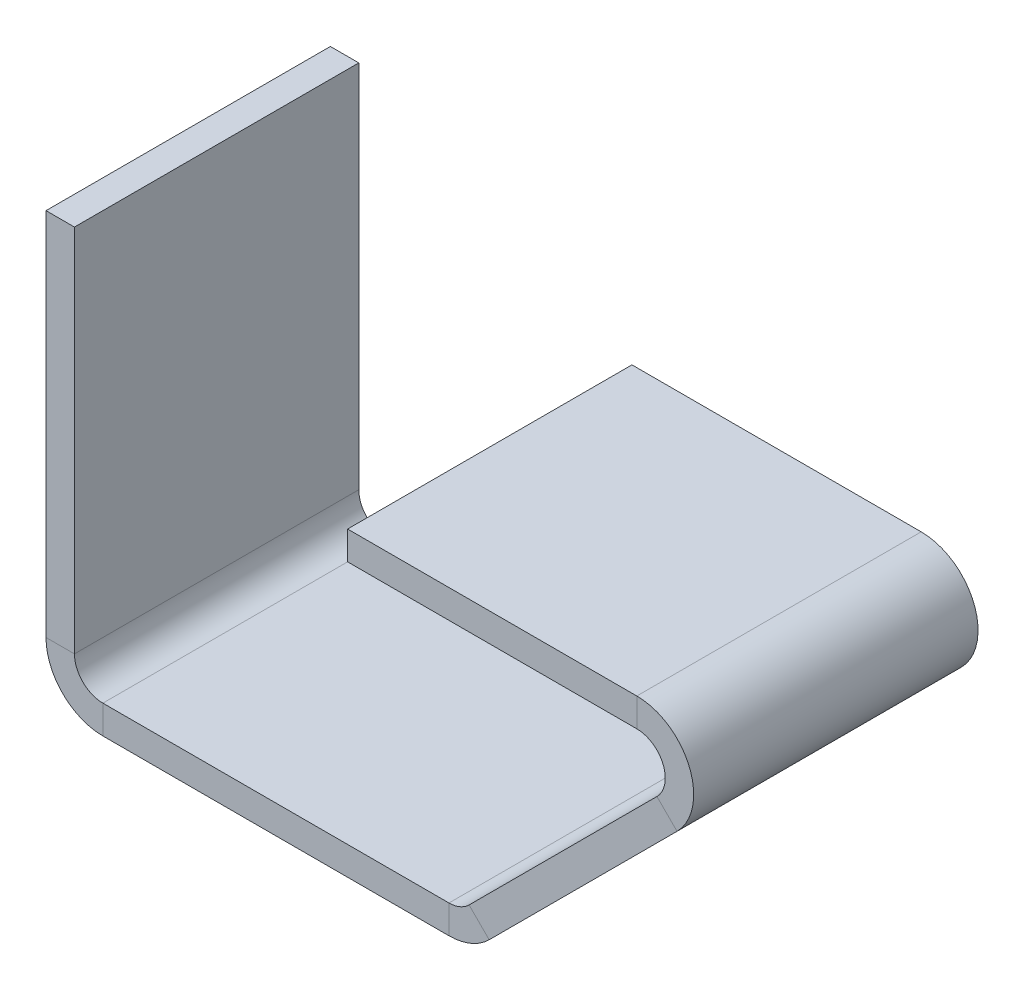
ISO-10303-21;
HEADER;
FILE_DESCRIPTION(('STEP AP214'),'2;1');
FILE_NAME('part.step','',(''),(''),'','','');
FILE_SCHEMA(('AUTOMOTIVE_DESIGN { 1 0 10303 214 1 1 1 1 }'));
ENDSEC;
DATA;
#1=APPLICATION_CONTEXT('core data for automotive mechanical design processes');
#2=APPLICATION_PROTOCOL_DEFINITION('international standard','automotive_design',2000,#1);
#3=PRODUCT_CONTEXT('',#1,'mechanical');
#4=PRODUCT('Part','Part','',(#3));
#5=PRODUCT_RELATED_PRODUCT_CATEGORY('part','',(#4));
#6=PRODUCT_DEFINITION_FORMATION('','',#4);
#7=PRODUCT_DEFINITION_CONTEXT('part definition',#1,'design');
#8=PRODUCT_DEFINITION('design','',#6,#7);
#9=PRODUCT_DEFINITION_SHAPE('','',#8);
#10=(LENGTH_UNIT() NAMED_UNIT(*) SI_UNIT(.MILLI.,.METRE.));
#11=(NAMED_UNIT(*) PLANE_ANGLE_UNIT() SI_UNIT($,.RADIAN.));
#12=(NAMED_UNIT(*) SI_UNIT($,.STERADIAN.) SOLID_ANGLE_UNIT());
#13=UNCERTAINTY_MEASURE_WITH_UNIT(LENGTH_MEASURE(1.E-05),#10,'distance_accuracy_value','');
#14=(GEOMETRIC_REPRESENTATION_CONTEXT(3) GLOBAL_UNCERTAINTY_ASSIGNED_CONTEXT((#13)) GLOBAL_UNIT_ASSIGNED_CONTEXT((#10,
#11,#12)) REPRESENTATION_CONTEXT('',''));
#15=CARTESIAN_POINT('',(0.,0.,0.));
#16=DIRECTION('',(0.,0.,1.));
#17=DIRECTION('',(1.,0.,0.));
#18=AXIS2_PLACEMENT_3D('',#15,#16,#17);
#19=CARTESIAN_POINT('',(0.,4.00000000000002,10.));
#20=DIRECTION('',(0.,0.,1.));
#21=DIRECTION('',(1.,0.,0.));
#22=AXIS2_PLACEMENT_3D('',#19,#20,#21);
#23=PLANE('',#22);
#24=DIRECTION('',(1.,0.,0.));
#25=VECTOR('',#24,1.);
#26=CARTESIAN_POINT('',(0.,4.00000000000002,10.));
#27=LINE('',#26,#25);
#28=CARTESIAN_POINT('',(0.,4.00000000000002,10.));
#29=VERTEX_POINT('',#28);
#30=CARTESIAN_POINT('',(2.,4.00000000000001,10.));
#31=VERTEX_POINT('',#30);
#32=EDGE_CURVE('E11',#29,#31,#27,.T.);
#33=ORIENTED_EDGE('',*,*,#32,.F.);
#34=CARTESIAN_POINT('',(4.,4.,10.));
#35=DIRECTION('',(0.,0.,-1.));
#36=DIRECTION('',(-1.,0.,0.));
#37=AXIS2_PLACEMENT_3D('',#34,#35,#36);
#38=CIRCLE('',#37,4.);
#39=CARTESIAN_POINT('',(4.,0.,10.));
#40=VERTEX_POINT('',#39);
#41=EDGE_CURVE('E359',#29,#40,#38,.F.);
#42=ORIENTED_EDGE('',*,*,#41,.T.);
#43=DIRECTION('',(0.,-1.,0.));
#44=VECTOR('',#43,1.);
#45=CARTESIAN_POINT('',(4.,2.,10.));
#46=LINE('',#45,#44);
#47=CARTESIAN_POINT('',(4.,2.,10.));
#48=VERTEX_POINT('',#47);
#49=EDGE_CURVE('E52',#48,#40,#46,.T.);
#50=ORIENTED_EDGE('',*,*,#49,.F.);
#51=CARTESIAN_POINT('',(4.,4.,10.));
#52=DIRECTION('',(0.,0.,1.));
#53=DIRECTION('',(1.,0.,0.));
#54=AXIS2_PLACEMENT_3D('',#51,#52,#53);
#55=CIRCLE('',#54,2.);
#56=EDGE_CURVE('E384',#31,#48,#55,.T.);
#57=ORIENTED_EDGE('',*,*,#56,.F.);
#58=EDGE_LOOP('',(#33,#42,#50,#57));
#59=FACE_BOUND('',#58,.T.);
#60=ADVANCED_FACE('F43',(#59),#23,.T.);
#61=CARTESIAN_POINT('',(4.,2.,10.));
#62=DIRECTION('',(0.,0.,1.));
#63=DIRECTION('',(1.,0.,0.));
#64=AXIS2_PLACEMENT_3D('',#61,#62,#63);
#65=PLANE('',#64);
#66=DIRECTION('',(0.,-1.,0.));
#67=VECTOR('',#66,1.);
#68=CARTESIAN_POINT('',(0.,30.,10.));
#69=LINE('',#68,#67);
#70=CARTESIAN_POINT('',(0.,30.,10.));
#71=VERTEX_POINT('',#70);
#72=EDGE_CURVE('E364',#71,#29,#69,.T.);
#73=ORIENTED_EDGE('',*,*,#72,.T.);
#74=ORIENTED_EDGE('',*,*,#32,.T.);
#75=DIRECTION('',(0.,1.,0.));
#76=VECTOR('',#75,1.);
#77=CARTESIAN_POINT('',(2.,30.,10.));
#78=LINE('',#77,#76);
#79=CARTESIAN_POINT('',(2.,30.,10.));
#80=VERTEX_POINT('',#79);
#81=EDGE_CURVE('E380',#80,#31,#78,.F.);
#82=ORIENTED_EDGE('',*,*,#81,.F.);
#83=DIRECTION('',(1.,0.,0.));
#84=VECTOR('',#83,1.);
#85=CARTESIAN_POINT('',(0.,30.,10.));
#86=LINE('',#85,#84);
#87=EDGE_CURVE('E376',#71,#80,#86,.T.);
#88=ORIENTED_EDGE('',*,*,#87,.F.);
#89=EDGE_LOOP('',(#73,#74,#82,#88));
#90=FACE_BOUND('',#89,.T.);
#91=ADVANCED_FACE('F470',(#90),#65,.T.);
#92=CARTESIAN_POINT('',(4.,0.,-10.));
#93=DIRECTION('',(0.,0.,-1.));
#94=DIRECTION('',(-1.,0.,0.));
#95=AXIS2_PLACEMENT_3D('',#92,#93,#94);
#96=PLANE('',#95);
#97=DIRECTION('',(0.,1.,0.));
#98=VECTOR('',#97,1.);
#99=CARTESIAN_POINT('',(4.,0.,-10.));
#100=LINE('',#99,#98);
#101=CARTESIAN_POINT('',(4.,0.,-10.));
#102=VERTEX_POINT('',#101);
#103=CARTESIAN_POINT('',(4.,2.,-10.));
#104=VERTEX_POINT('',#103);
#105=EDGE_CURVE('E342',#102,#104,#100,.T.);
#106=ORIENTED_EDGE('',*,*,#105,.F.);
#107=CARTESIAN_POINT('',(4.,4.,-10.));
#108=DIRECTION('',(0.,0.,-1.));
#109=DIRECTION('',(-1.,0.,0.));
#110=AXIS2_PLACEMENT_3D('',#107,#108,#109);
#111=CIRCLE('',#110,4.);
#112=CARTESIAN_POINT('',(0.,4.00000000000002,-10.));
#113=VERTEX_POINT('',#112);
#114=EDGE_CURVE('E256',#113,#102,#111,.F.);
#115=ORIENTED_EDGE('',*,*,#114,.F.);
#116=DIRECTION('',(-1.,0.,0.));
#117=VECTOR('',#116,1.);
#118=CARTESIAN_POINT('',(2.,4.00000000000001,-10.));
#119=LINE('',#118,#117);
#120=CARTESIAN_POINT('',(2.,4.00000000000001,-10.));
#121=VERTEX_POINT('',#120);
#122=EDGE_CURVE('E339',#121,#113,#119,.T.);
#123=ORIENTED_EDGE('',*,*,#122,.F.);
#124=CARTESIAN_POINT('',(4.,4.,-10.));
#125=DIRECTION('',(0.,0.,1.));
#126=DIRECTION('',(1.,0.,0.));
#127=AXIS2_PLACEMENT_3D('',#124,#125,#126);
#128=CIRCLE('',#127,2.);
#129=EDGE_CURVE('E240',#121,#104,#128,.T.);
#130=ORIENTED_EDGE('',*,*,#129,.T.);
#131=EDGE_LOOP('',(#106,#115,#123,#130));
#132=FACE_BOUND('',#131,.T.);
#133=ADVANCED_FACE('F480',(#132),#96,.T.);
#134=CARTESIAN_POINT('',(2.,4.00000000000001,-10.));
#135=DIRECTION('',(0.,0.,-1.));
#136=DIRECTION('',(-1.,0.,0.));
#137=AXIS2_PLACEMENT_3D('',#134,#135,#136);
#138=PLANE('',#137);
#139=DIRECTION('',(1.,0.,0.));
#140=VECTOR('',#139,1.);
#141=CARTESIAN_POINT('',(0.,0.,-10.));
#142=LINE('',#141,#140);
#143=CARTESIAN_POINT('',(28.3431457505076,0.,-10.));
#144=VERTEX_POINT('',#143);
#145=EDGE_CURVE('E260',#102,#144,#142,.T.);
#146=ORIENTED_EDGE('',*,*,#145,.F.);
#147=ORIENTED_EDGE('',*,*,#105,.T.);
#148=DIRECTION('',(1.,0.,0.));
#149=VECTOR('',#148,1.);
#150=CARTESIAN_POINT('',(0.,2.,-10.));
#151=LINE('',#150,#149);
#152=CARTESIAN_POINT('',(28.3431457505076,2.,-10.));
#153=VERTEX_POINT('',#152);
#154=EDGE_CURVE('E236',#104,#153,#151,.T.);
#155=ORIENTED_EDGE('',*,*,#154,.T.);
#156=DIRECTION('',(0.,-1.,0.));
#157=VECTOR('',#156,1.);
#158=CARTESIAN_POINT('',(28.3431457505076,2.,-10.));
#159=LINE('',#158,#157);
#160=EDGE_CURVE('E332',#153,#144,#159,.T.);
#161=ORIENTED_EDGE('',*,*,#160,.T.);
#162=EDGE_LOOP('',(#146,#147,#155,#161));
#163=FACE_BOUND('',#162,.T.);
#164=ADVANCED_FACE('F482',(#163),#138,.T.);
#165=CARTESIAN_POINT('',(28.3431457505076,0.,10.));
#166=DIRECTION('',(0.,0.,1.));
#167=DIRECTION('',(1.,0.,0.));
#168=AXIS2_PLACEMENT_3D('',#165,#166,#167);
#169=PLANE('',#168);
#170=DIRECTION('',(0.,1.,0.));
#171=VECTOR('',#170,1.);
#172=CARTESIAN_POINT('',(28.3431457505076,0.,10.));
#173=LINE('',#172,#171);
#174=CARTESIAN_POINT('',(28.3431457505076,0.,10.));
#175=VERTEX_POINT('',#174);
#176=CARTESIAN_POINT('',(28.3431457505076,2.,10.));
#177=VERTEX_POINT('',#176);
#178=EDGE_CURVE('E178',#175,#177,#173,.T.);
#179=ORIENTED_EDGE('',*,*,#178,.F.);
#180=CARTESIAN_POINT('',(28.3431457505076,4.,10.));
#181=DIRECTION('',(0.,0.,-1.));
#182=DIRECTION('',(-1.,0.,0.));
#183=AXIS2_PLACEMENT_3D('',#180,#181,#182);
#184=CIRCLE('',#183,4.);
#185=CARTESIAN_POINT('',(31.1715728752538,1.17157287525381,10.));
#186=VERTEX_POINT('',#185);
#187=EDGE_CURVE('E182',#175,#186,#184,.F.);
#188=ORIENTED_EDGE('',*,*,#187,.T.);
#189=DIRECTION('',(0.707106781186549,-0.707106781186547,0.));
#190=VECTOR('',#189,1.);
#191=CARTESIAN_POINT('',(29.7573593128807,2.58578643762691,10.));
#192=LINE('',#191,#190);
#193=CARTESIAN_POINT('',(29.7573593128807,2.58578643762691,10.));
#194=VERTEX_POINT('',#193);
#195=EDGE_CURVE('E165',#194,#186,#192,.T.);
#196=ORIENTED_EDGE('',*,*,#195,.F.);
#197=CARTESIAN_POINT('',(28.3431457505076,4.,10.));
#198=DIRECTION('',(0.,0.,1.));
#199=DIRECTION('',(1.,0.,0.));
#200=AXIS2_PLACEMENT_3D('',#197,#198,#199);
#201=CIRCLE('',#200,2.);
#202=EDGE_CURVE('E389',#177,#194,#201,.T.);
#203=ORIENTED_EDGE('',*,*,#202,.F.);
#204=EDGE_LOOP('',(#179,#188,#196,#203));
#205=FACE_BOUND('',#204,.T.);
#206=ADVANCED_FACE('F184',(#205),#169,.T.);
#207=CARTESIAN_POINT('',(29.7573593128807,2.58578643762691,10.));
#208=DIRECTION('',(0.,0.,1.));
#209=DIRECTION('',(1.,0.,0.));
#210=AXIS2_PLACEMENT_3D('',#207,#208,#209);
#211=PLANE('',#210);
#212=DIRECTION('',(1.,0.,0.));
#213=VECTOR('',#212,1.);
#214=CARTESIAN_POINT('',(0.,0.,10.));
#215=LINE('',#214,#213);
#216=EDGE_CURVE('E189',#40,#175,#215,.T.);
#217=ORIENTED_EDGE('',*,*,#216,.T.);
#218=ORIENTED_EDGE('',*,*,#178,.T.);
#219=DIRECTION('',(1.,0.,0.));
#220=VECTOR('',#219,1.);
#221=CARTESIAN_POINT('',(0.,2.,10.));
#222=LINE('',#221,#220);
#223=EDGE_CURVE('E353',#48,#177,#222,.T.);
#224=ORIENTED_EDGE('',*,*,#223,.F.);
#225=ORIENTED_EDGE('',*,*,#49,.T.);
#226=EDGE_LOOP('',(#217,#218,#224,#225));
#227=FACE_BOUND('',#226,.T.);
#228=ADVANCED_FACE('F349',(#227),#211,.T.);
#229=CARTESIAN_POINT('',(31.1715728752538,1.17157287525381,-10.));
#230=DIRECTION('',(0.,0.,-1.));
#231=DIRECTION('',(-1.,0.,0.));
#232=AXIS2_PLACEMENT_3D('',#229,#230,#231);
#233=PLANE('',#232);
#234=DIRECTION('',(-0.707106781186549,0.707106781186547,0.));
#235=VECTOR('',#234,1.);
#236=CARTESIAN_POINT('',(31.1715728752538,1.17157287525381,-10.));
#237=LINE('',#236,#235);
#238=CARTESIAN_POINT('',(31.1715728752538,1.17157287525381,-10.));
#239=VERTEX_POINT('',#238);
#240=CARTESIAN_POINT('',(29.7573593128807,2.58578643762691,-10.));
#241=VERTEX_POINT('',#240);
#242=EDGE_CURVE('E179',#239,#241,#237,.T.);
#243=ORIENTED_EDGE('',*,*,#242,.F.);
#244=CARTESIAN_POINT('',(28.3431457505076,4.,-10.));
#245=DIRECTION('',(0.,0.,-1.));
#246=DIRECTION('',(-1.,0.,0.));
#247=AXIS2_PLACEMENT_3D('',#244,#245,#246);
#248=CIRCLE('',#247,4.);
#249=EDGE_CURVE('E196',#144,#239,#248,.F.);
#250=ORIENTED_EDGE('',*,*,#249,.F.);
#251=ORIENTED_EDGE('',*,*,#160,.F.);
#252=CARTESIAN_POINT('',(28.3431457505076,4.,-10.));
#253=DIRECTION('',(0.,0.,1.));
#254=DIRECTION('',(1.,0.,0.));
#255=AXIS2_PLACEMENT_3D('',#252,#253,#254);
#256=CIRCLE('',#255,2.);
#257=EDGE_CURVE('E232',#153,#241,#256,.T.);
#258=ORIENTED_EDGE('',*,*,#257,.T.);
#259=EDGE_LOOP('',(#243,#250,#251,#258));
#260=FACE_BOUND('',#259,.T.);
#261=ADVANCED_FACE('F484',(#260),#233,.T.);
#262=CARTESIAN_POINT('',(28.3431457505076,2.,-10.));
#263=DIRECTION('',(0.,0.,-1.));
#264=DIRECTION('',(-1.,0.,0.));
#265=AXIS2_PLACEMENT_3D('',#262,#263,#264);
#266=PLANE('',#265);
#267=DIRECTION('',(0.707106781186546,0.707106781186549,0.));
#268=VECTOR('',#267,1.);
#269=CARTESIAN_POINT('',(30.,0.,-10.));
#270=LINE('',#269,#268);
#271=CARTESIAN_POINT('',(44.3847763108502,14.3847763108503,-10.));
#272=VERTEX_POINT('',#271);
#273=EDGE_CURVE('E266',#239,#272,#270,.T.);
#274=ORIENTED_EDGE('',*,*,#273,.F.);
#275=ORIENTED_EDGE('',*,*,#242,.T.);
#276=DIRECTION('',(0.707106781186546,0.707106781186549,0.));
#277=VECTOR('',#276,1.);
#278=CARTESIAN_POINT('',(28.5857864376269,1.41421356237309,-10.));
#279=LINE('',#278,#277);
#280=CARTESIAN_POINT('',(42.9705627484771,15.7989898732234,-10.));
#281=VERTEX_POINT('',#280);
#282=EDGE_CURVE('E229',#241,#281,#279,.T.);
#283=ORIENTED_EDGE('',*,*,#282,.T.);
#284=DIRECTION('',(0.707106781186548,-0.707106781186547,0.));
#285=VECTOR('',#284,1.);
#286=CARTESIAN_POINT('',(42.9705627484771,15.7989898732234,-10.));
#287=LINE('',#286,#285);
#288=EDGE_CURVE('E113',#281,#272,#287,.T.);
#289=ORIENTED_EDGE('',*,*,#288,.T.);
#290=EDGE_LOOP('',(#274,#275,#283,#289));
#291=FACE_BOUND('',#290,.T.);
#292=ADVANCED_FACE('F485',(#291),#266,.T.);
#293=CARTESIAN_POINT('',(44.3847763108502,14.3847763108503,10.));
#294=DIRECTION('',(0.,0.,1.));
#295=DIRECTION('',(1.,0.,0.));
#296=AXIS2_PLACEMENT_3D('',#293,#294,#295);
#297=PLANE('',#296);
#298=DIRECTION('',(-0.707106781186548,0.707106781186547,0.));
#299=VECTOR('',#298,1.);
#300=CARTESIAN_POINT('',(44.3847763108502,14.3847763108503,10.));
#301=LINE('',#300,#299);
#302=CARTESIAN_POINT('',(44.3847763108502,14.3847763108503,10.));
#303=VERTEX_POINT('',#302);
#304=CARTESIAN_POINT('',(42.9705627484771,15.7989898732234,10.));
#305=VERTEX_POINT('',#304);
#306=EDGE_CURVE('E329',#303,#305,#301,.T.);
#307=ORIENTED_EDGE('',*,*,#306,.F.);
#308=CARTESIAN_POINT('',(41.556349186104,17.2132034355965,10.));
#309=DIRECTION('',(0.,0.,-1.));
#310=DIRECTION('',(-1.,0.,0.));
#311=AXIS2_PLACEMENT_3D('',#308,#309,#310);
#312=CIRCLE('',#311,4.);
#313=CARTESIAN_POINT('',(41.556349186104,21.2132034355965,10.));
#314=VERTEX_POINT('',#313);
#315=EDGE_CURVE('E206',#303,#314,#312,.F.);
#316=ORIENTED_EDGE('',*,*,#315,.T.);
#317=DIRECTION('',(0.,1.,0.));
#318=VECTOR('',#317,1.);
#319=CARTESIAN_POINT('',(41.556349186104,19.2132034355965,10.));
#320=LINE('',#319,#318);
#321=CARTESIAN_POINT('',(41.556349186104,19.2132034355965,10.));
#322=VERTEX_POINT('',#321);
#323=EDGE_CURVE('E60',#322,#314,#320,.T.);
#324=ORIENTED_EDGE('',*,*,#323,.F.);
#325=CARTESIAN_POINT('',(41.556349186104,17.2132034355965,10.));
#326=DIRECTION('',(0.,0.,1.));
#327=DIRECTION('',(1.,0.,0.));
#328=AXIS2_PLACEMENT_3D('',#325,#326,#327);
#329=CIRCLE('',#328,2.);
#330=EDGE_CURVE('E394',#305,#322,#329,.T.);
#331=ORIENTED_EDGE('',*,*,#330,.F.);
#332=EDGE_LOOP('',(#307,#316,#324,#331));
#333=FACE_BOUND('',#332,.T.);
#334=ADVANCED_FACE('F449',(#333),#297,.T.);
#335=CARTESIAN_POINT('',(41.556349186104,19.2132034355965,10.));
#336=DIRECTION('',(0.,0.,1.));
#337=DIRECTION('',(1.,0.,0.));
#338=AXIS2_PLACEMENT_3D('',#335,#336,#337);
#339=PLANE('',#338);
#340=DIRECTION('',(0.707106781186546,0.707106781186549,0.));
#341=VECTOR('',#340,1.);
#342=CARTESIAN_POINT('',(30.,0.,10.));
#343=LINE('',#342,#341);
#344=EDGE_CURVE('E169',#186,#303,#343,.T.);
#345=ORIENTED_EDGE('',*,*,#344,.T.);
#346=ORIENTED_EDGE('',*,*,#306,.T.);
#347=DIRECTION('',(0.707106781186546,0.707106781186549,0.));
#348=VECTOR('',#347,1.);
#349=CARTESIAN_POINT('',(28.5857864376269,1.41421356237309,10.));
#350=LINE('',#349,#348);
#351=EDGE_CURVE('E172',#194,#305,#350,.T.);
#352=ORIENTED_EDGE('',*,*,#351,.F.);
#353=ORIENTED_EDGE('',*,*,#195,.T.);
#354=EDGE_LOOP('',(#345,#346,#352,#353));
#355=FACE_BOUND('',#354,.T.);
#356=ADVANCED_FACE('F167',(#355),#339,.T.);
#357=CARTESIAN_POINT('',(41.556349186104,21.2132034355965,-10.));
#358=DIRECTION('',(0.,0.,-1.));
#359=DIRECTION('',(-1.,0.,0.));
#360=AXIS2_PLACEMENT_3D('',#357,#358,#359);
#361=PLANE('',#360);
#362=DIRECTION('',(0.,-1.,0.));
#363=VECTOR('',#362,1.);
#364=CARTESIAN_POINT('',(41.556349186104,21.2132034355965,-10.));
#365=LINE('',#364,#363);
#366=CARTESIAN_POINT('',(41.556349186104,21.2132034355965,-10.));
#367=VERTEX_POINT('',#366);
#368=CARTESIAN_POINT('',(41.556349186104,19.2132034355965,-10.));
#369=VERTEX_POINT('',#368);
#370=EDGE_CURVE('E120',#367,#369,#365,.T.);
#371=ORIENTED_EDGE('',*,*,#370,.F.);
#372=CARTESIAN_POINT('',(41.556349186104,17.2132034355965,-10.));
#373=DIRECTION('',(0.,0.,-1.));
#374=DIRECTION('',(-1.,0.,0.));
#375=AXIS2_PLACEMENT_3D('',#372,#373,#374);
#376=CIRCLE('',#375,4.);
#377=EDGE_CURVE('E269',#272,#367,#376,.F.);
#378=ORIENTED_EDGE('',*,*,#377,.F.);
#379=ORIENTED_EDGE('',*,*,#288,.F.);
#380=CARTESIAN_POINT('',(41.556349186104,17.2132034355965,-10.));
#381=DIRECTION('',(0.,0.,1.));
#382=DIRECTION('',(1.,0.,0.));
#383=AXIS2_PLACEMENT_3D('',#380,#381,#382);
#384=CIRCLE('',#383,2.);
#385=EDGE_CURVE('E226',#281,#369,#384,.T.);
#386=ORIENTED_EDGE('',*,*,#385,.T.);
#387=EDGE_LOOP('',(#371,#378,#379,#386));
#388=FACE_BOUND('',#387,.T.);
#389=ADVANCED_FACE('F489',(#388),#361,.T.);
#390=CARTESIAN_POINT('',(42.9705627484771,15.7989898732234,-10.));
#391=DIRECTION('',(0.,0.,-1.));
#392=DIRECTION('',(-1.,0.,0.));
#393=AXIS2_PLACEMENT_3D('',#390,#391,#392);
#394=PLANE('',#393);
#395=DIRECTION('',(-1.,0.,0.));
#396=VECTOR('',#395,1.);
#397=CARTESIAN_POINT('',(51.2132034355964,21.2132034355965,-10.));
#398=LINE('',#397,#396);
#399=CARTESIAN_POINT('',(21.2132034355964,21.2132034355965,-10.));
#400=VERTEX_POINT('',#399);
#401=EDGE_CURVE('E214',#367,#400,#398,.T.);
#402=ORIENTED_EDGE('',*,*,#401,.F.);
#403=ORIENTED_EDGE('',*,*,#370,.T.);
#404=DIRECTION('',(-1.,0.,0.));
#405=VECTOR('',#404,1.);
#406=CARTESIAN_POINT('',(51.2132034355964,19.2132034355965,-10.));
#407=LINE('',#406,#405);
#408=CARTESIAN_POINT('',(21.2132034355964,19.2132034355965,-10.));
#409=VERTEX_POINT('',#408);
#410=EDGE_CURVE('E222',#369,#409,#407,.T.);
#411=ORIENTED_EDGE('',*,*,#410,.T.);
#412=DIRECTION('',(0.,1.,0.));
#413=VECTOR('',#412,1.);
#414=CARTESIAN_POINT('',(21.2132034355964,19.2132034355965,-10.));
#415=LINE('',#414,#413);
#416=EDGE_CURVE('E218',#409,#400,#415,.T.);
#417=ORIENTED_EDGE('',*,*,#416,.T.);
#418=EDGE_LOOP('',(#402,#403,#411,#417));
#419=FACE_BOUND('',#418,.T.);
#420=ADVANCED_FACE('F491',(#419),#394,.T.);
#421=CARTESIAN_POINT('',(51.2132034355964,21.2132034355965,10.));
#422=DIRECTION('',(0.,-1.,0.));
#423=DIRECTION('',(1.,0.,0.));
#424=AXIS2_PLACEMENT_3D('',#421,#422,#423);
#425=PLANE('',#424);
#426=ORIENTED_EDGE('',*,*,#401,.T.);
#427=DIRECTION('',(0.,0.,-1.));
#428=VECTOR('',#427,1.);
#429=CARTESIAN_POINT('',(21.2132034355964,21.2132034355965,10.));
#430=LINE('',#429,#428);
#431=CARTESIAN_POINT('',(21.2132034355964,21.2132034355965,10.));
#432=VERTEX_POINT('',#431);
#433=EDGE_CURVE('E320',#432,#400,#430,.T.);
#434=ORIENTED_EDGE('',*,*,#433,.F.);
#435=DIRECTION('',(-1.,0.,0.));
#436=VECTOR('',#435,1.);
#437=CARTESIAN_POINT('',(51.2132034355964,21.2132034355965,10.));
#438=LINE('',#437,#436);
#439=EDGE_CURVE('E126',#314,#432,#438,.T.);
#440=ORIENTED_EDGE('',*,*,#439,.F.);
#441=DIRECTION('',(0.,0.,-1.));
#442=VECTOR('',#441,1.);
#443=CARTESIAN_POINT('',(41.556349186104,21.2132034355965,10.));
#444=LINE('',#443,#442);
#445=EDGE_CURVE('E210',#314,#367,#444,.T.);
#446=ORIENTED_EDGE('',*,*,#445,.T.);
#447=EDGE_LOOP('',(#426,#434,#440,#446));
#448=FACE_BOUND('',#447,.T.);
#449=ADVANCED_FACE('F497',(#448),#425,.F.);
#450=CARTESIAN_POINT('',(21.2132034355964,19.2132034355965,10.));
#451=DIRECTION('',(-1.,0.,0.));
#452=DIRECTION('',(0.,0.,1.));
#453=AXIS2_PLACEMENT_3D('',#450,#451,#452);
#454=PLANE('',#453);
#455=ORIENTED_EDGE('',*,*,#416,.F.);
#456=DIRECTION('',(0.,0.,-1.));
#457=VECTOR('',#456,1.);
#458=CARTESIAN_POINT('',(21.2132034355964,19.2132034355965,10.));
#459=LINE('',#458,#457);
#460=CARTESIAN_POINT('',(21.2132034355964,19.2132034355965,10.));
#461=VERTEX_POINT('',#460);
#462=EDGE_CURVE('E317',#461,#409,#459,.T.);
#463=ORIENTED_EDGE('',*,*,#462,.F.);
#464=DIRECTION('',(0.,1.,0.));
#465=VECTOR('',#464,1.);
#466=CARTESIAN_POINT('',(21.2132034355964,19.2132034355965,10.));
#467=LINE('',#466,#465);
#468=EDGE_CURVE('E402',#461,#432,#467,.T.);
#469=ORIENTED_EDGE('',*,*,#468,.T.);
#470=ORIENTED_EDGE('',*,*,#433,.T.);
#471=EDGE_LOOP('',(#455,#463,#469,#470));
#472=FACE_BOUND('',#471,.T.);
#473=ADVANCED_FACE('F437',(#472),#454,.T.);
#474=CARTESIAN_POINT('',(51.2132034355964,19.2132034355965,10.));
#475=DIRECTION('',(0.,-1.,0.));
#476=DIRECTION('',(1.,0.,0.));
#477=AXIS2_PLACEMENT_3D('',#474,#475,#476);
#478=PLANE('',#477);
#479=ORIENTED_EDGE('',*,*,#410,.F.);
#480=DIRECTION('',(0.,0.,-1.));
#481=VECTOR('',#480,1.);
#482=CARTESIAN_POINT('',(41.556349186104,19.2132034355965,10.));
#483=LINE('',#482,#481);
#484=EDGE_CURVE('E313',#322,#369,#483,.T.);
#485=ORIENTED_EDGE('',*,*,#484,.F.);
#486=DIRECTION('',(-1.,0.,0.));
#487=VECTOR('',#486,1.);
#488=CARTESIAN_POINT('',(51.2132034355964,19.2132034355965,10.));
#489=LINE('',#488,#487);
#490=EDGE_CURVE('E398',#322,#461,#489,.T.);
#491=ORIENTED_EDGE('',*,*,#490,.T.);
#492=ORIENTED_EDGE('',*,*,#462,.T.);
#493=EDGE_LOOP('',(#479,#485,#491,#492));
#494=FACE_BOUND('',#493,.T.);
#495=ADVANCED_FACE('F442',(#494),#478,.T.);
#496=CARTESIAN_POINT('',(41.556349186104,17.2132034355965,10.));
#497=DIRECTION('',(0.,0.,-1.));
#498=DIRECTION('',(-1.,0.,0.));
#499=AXIS2_PLACEMENT_3D('',#496,#497,#498);
#500=CYLINDRICAL_SURFACE('',#499,2.);
#501=ORIENTED_EDGE('',*,*,#385,.F.);
#502=DIRECTION('',(0.,0.,-1.));
#503=VECTOR('',#502,1.);
#504=CARTESIAN_POINT('',(42.9705627484771,15.7989898732234,10.));
#505=LINE('',#504,#503);
#506=EDGE_CURVE('E309',#305,#281,#505,.T.);
#507=ORIENTED_EDGE('',*,*,#506,.F.);
#508=ORIENTED_EDGE('',*,*,#330,.T.);
#509=ORIENTED_EDGE('',*,*,#484,.T.);
#510=EDGE_LOOP('',(#501,#507,#508,#509));
#511=FACE_BOUND('',#510,.T.);
#512=ADVANCED_FACE('F445',(#511),#500,.F.);
#513=CARTESIAN_POINT('',(28.5857864376269,1.41421356237309,10.));
#514=DIRECTION('',(-0.707106781186549,0.707106781186546,0.));
#515=DIRECTION('',(-0.707106781186546,-0.707106781186549,0.));
#516=AXIS2_PLACEMENT_3D('',#513,#514,#515);
#517=PLANE('',#516);
#518=ORIENTED_EDGE('',*,*,#282,.F.);
#519=DIRECTION('',(0.,0.,-1.));
#520=VECTOR('',#519,1.);
#521=CARTESIAN_POINT('',(29.7573593128807,2.58578643762691,10.));
#522=LINE('',#521,#520);
#523=EDGE_CURVE('E305',#194,#241,#522,.T.);
#524=ORIENTED_EDGE('',*,*,#523,.F.);
#525=ORIENTED_EDGE('',*,*,#351,.T.);
#526=ORIENTED_EDGE('',*,*,#506,.T.);
#527=EDGE_LOOP('',(#518,#524,#525,#526));
#528=FACE_BOUND('',#527,.T.);
#529=ADVANCED_FACE('F452',(#528),#517,.T.);
#530=CARTESIAN_POINT('',(28.3431457505076,4.,10.));
#531=DIRECTION('',(0.,0.,-1.));
#532=DIRECTION('',(-1.,0.,0.));
#533=AXIS2_PLACEMENT_3D('',#530,#531,#532);
#534=CYLINDRICAL_SURFACE('',#533,2.);
#535=ORIENTED_EDGE('',*,*,#257,.F.);
#536=DIRECTION('',(0.,0.,-1.));
#537=VECTOR('',#536,1.);
#538=CARTESIAN_POINT('',(28.3431457505076,2.,10.));
#539=LINE('',#538,#537);
#540=EDGE_CURVE('E301',#177,#153,#539,.T.);
#541=ORIENTED_EDGE('',*,*,#540,.F.);
#542=ORIENTED_EDGE('',*,*,#202,.T.);
#543=ORIENTED_EDGE('',*,*,#523,.T.);
#544=EDGE_LOOP('',(#535,#541,#542,#543));
#545=FACE_BOUND('',#544,.T.);
#546=ADVANCED_FACE('F455',(#545),#534,.F.);
#547=CARTESIAN_POINT('',(0.,2.,10.));
#548=DIRECTION('',(0.,1.,0.));
#549=DIRECTION('',(0.,0.,1.));
#550=AXIS2_PLACEMENT_3D('',#547,#548,#549);
#551=PLANE('',#550);
#552=ORIENTED_EDGE('',*,*,#154,.F.);
#553=DIRECTION('',(0.,0.,-1.));
#554=VECTOR('',#553,1.);
#555=CARTESIAN_POINT('',(4.,2.,10.));
#556=LINE('',#555,#554);
#557=EDGE_CURVE('E297',#48,#104,#556,.T.);
#558=ORIENTED_EDGE('',*,*,#557,.F.);
#559=ORIENTED_EDGE('',*,*,#223,.T.);
#560=ORIENTED_EDGE('',*,*,#540,.T.);
#561=EDGE_LOOP('',(#552,#558,#559,#560));
#562=FACE_BOUND('',#561,.T.);
#563=ADVANCED_FACE('F459',(#562),#551,.T.);
#564=CARTESIAN_POINT('',(4.,4.,10.));
#565=DIRECTION('',(0.,0.,-1.));
#566=DIRECTION('',(-1.,0.,0.));
#567=AXIS2_PLACEMENT_3D('',#564,#565,#566);
#568=CYLINDRICAL_SURFACE('',#567,2.);
#569=ORIENTED_EDGE('',*,*,#129,.F.);
#570=DIRECTION('',(0.,0.,-1.));
#571=VECTOR('',#570,1.);
#572=CARTESIAN_POINT('',(2.,4.00000000000001,10.));
#573=LINE('',#572,#571);
#574=EDGE_CURVE('E293',#31,#121,#573,.T.);
#575=ORIENTED_EDGE('',*,*,#574,.F.);
#576=ORIENTED_EDGE('',*,*,#56,.T.);
#577=ORIENTED_EDGE('',*,*,#557,.T.);
#578=EDGE_LOOP('',(#569,#575,#576,#577));
#579=FACE_BOUND('',#578,.T.);
#580=ADVANCED_FACE('F462',(#579),#568,.F.);
#581=CARTESIAN_POINT('',(2.,30.,10.));
#582=DIRECTION('',(1.,0.,0.));
#583=DIRECTION('',(0.,0.,-1.));
#584=AXIS2_PLACEMENT_3D('',#581,#582,#583);
#585=PLANE('',#584);
#586=DIRECTION('',(0.,1.,0.));
#587=VECTOR('',#586,1.);
#588=CARTESIAN_POINT('',(2.,30.,-10.));
#589=LINE('',#588,#587);
#590=CARTESIAN_POINT('',(2.,30.,-10.));
#591=VERTEX_POINT('',#590);
#592=EDGE_CURVE('E244',#591,#121,#589,.F.);
#593=ORIENTED_EDGE('',*,*,#592,.F.);
#594=DIRECTION('',(0.,0.,-1.));
#595=VECTOR('',#594,1.);
#596=CARTESIAN_POINT('',(2.,30.,10.));
#597=LINE('',#596,#595);
#598=EDGE_CURVE('E290',#80,#591,#597,.T.);
#599=ORIENTED_EDGE('',*,*,#598,.F.);
#600=ORIENTED_EDGE('',*,*,#81,.T.);
#601=ORIENTED_EDGE('',*,*,#574,.T.);
#602=EDGE_LOOP('',(#593,#599,#600,#601));
#603=FACE_BOUND('',#602,.T.);
#604=ADVANCED_FACE('F467',(#603),#585,.T.);
#605=CARTESIAN_POINT('',(0.,30.,10.));
#606=DIRECTION('',(0.,1.,0.));
#607=DIRECTION('',(0.,0.,1.));
#608=AXIS2_PLACEMENT_3D('',#605,#606,#607);
#609=PLANE('',#608);
#610=DIRECTION('',(1.,0.,0.));
#611=VECTOR('',#610,1.);
#612=CARTESIAN_POINT('',(0.,30.,-10.));
#613=LINE('',#612,#611);
#614=CARTESIAN_POINT('',(0.,30.,-10.));
#615=VERTEX_POINT('',#614);
#616=EDGE_CURVE('E248',#615,#591,#613,.T.);
#617=ORIENTED_EDGE('',*,*,#616,.F.);
#618=DIRECTION('',(0.,0.,-1.));
#619=VECTOR('',#618,1.);
#620=CARTESIAN_POINT('',(0.,30.,10.));
#621=LINE('',#620,#619);
#622=EDGE_CURVE('E287',#71,#615,#621,.T.);
#623=ORIENTED_EDGE('',*,*,#622,.F.);
#624=ORIENTED_EDGE('',*,*,#87,.T.);
#625=ORIENTED_EDGE('',*,*,#598,.T.);
#626=EDGE_LOOP('',(#617,#623,#624,#625));
#627=FACE_BOUND('',#626,.T.);
#628=ADVANCED_FACE('F473',(#627),#609,.T.);
#629=CARTESIAN_POINT('',(0.,30.,10.));
#630=DIRECTION('',(1.,0.,0.));
#631=DIRECTION('',(0.,0.,-1.));
#632=AXIS2_PLACEMENT_3D('',#629,#630,#631);
#633=PLANE('',#632);
#634=DIRECTION('',(0.,-1.,0.));
#635=VECTOR('',#634,1.);
#636=CARTESIAN_POINT('',(0.,30.,-10.));
#637=LINE('',#636,#635);
#638=EDGE_CURVE('E252',#615,#113,#637,.T.);
#639=ORIENTED_EDGE('',*,*,#638,.T.);
#640=DIRECTION('',(0.,0.,-1.));
#641=VECTOR('',#640,1.);
#642=CARTESIAN_POINT('',(0.,4.00000000000002,10.));
#643=LINE('',#642,#641);
#644=EDGE_CURVE('E283',#29,#113,#643,.T.);
#645=ORIENTED_EDGE('',*,*,#644,.F.);
#646=ORIENTED_EDGE('',*,*,#72,.F.);
#647=ORIENTED_EDGE('',*,*,#622,.T.);
#648=EDGE_LOOP('',(#639,#645,#646,#647));
#649=FACE_BOUND('',#648,.T.);
#650=ADVANCED_FACE('F478',(#649),#633,.F.);
#651=CARTESIAN_POINT('',(4.,4.,10.));
#652=DIRECTION('',(0.,0.,-1.));
#653=DIRECTION('',(-1.,0.,0.));
#654=AXIS2_PLACEMENT_3D('',#651,#652,#653);
#655=CYLINDRICAL_SURFACE('',#654,4.);
#656=ORIENTED_EDGE('',*,*,#114,.T.);
#657=DIRECTION('',(0.,0.,-1.));
#658=VECTOR('',#657,1.);
#659=CARTESIAN_POINT('',(4.,0.,10.));
#660=LINE('',#659,#658);
#661=EDGE_CURVE('E279',#40,#102,#660,.T.);
#662=ORIENTED_EDGE('',*,*,#661,.F.);
#663=ORIENTED_EDGE('',*,*,#41,.F.);
#664=ORIENTED_EDGE('',*,*,#644,.T.);
#665=EDGE_LOOP('',(#656,#662,#663,#664));
#666=FACE_BOUND('',#665,.T.);
#667=ADVANCED_FACE('F366',(#666),#655,.T.);
#668=CARTESIAN_POINT('',(0.,0.,10.));
#669=DIRECTION('',(0.,1.,0.));
#670=DIRECTION('',(0.,0.,1.));
#671=AXIS2_PLACEMENT_3D('',#668,#669,#670);
#672=PLANE('',#671);
#673=ORIENTED_EDGE('',*,*,#145,.T.);
#674=DIRECTION('',(0.,0.,-1.));
#675=VECTOR('',#674,1.);
#676=CARTESIAN_POINT('',(28.3431457505076,0.,10.));
#677=LINE('',#676,#675);
#678=EDGE_CURVE('E199',#175,#144,#677,.T.);
#679=ORIENTED_EDGE('',*,*,#678,.F.);
#680=ORIENTED_EDGE('',*,*,#216,.F.);
#681=ORIENTED_EDGE('',*,*,#661,.T.);
#682=EDGE_LOOP('',(#673,#679,#680,#681));
#683=FACE_BOUND('',#682,.T.);
#684=ADVANCED_FACE('F370',(#683),#672,.F.);
#685=CARTESIAN_POINT('',(28.3431457505076,4.,10.));
#686=DIRECTION('',(0.,0.,-1.));
#687=DIRECTION('',(-1.,0.,0.));
#688=AXIS2_PLACEMENT_3D('',#685,#686,#687);
#689=CYLINDRICAL_SURFACE('',#688,4.);
#690=ORIENTED_EDGE('',*,*,#249,.T.);
#691=DIRECTION('',(0.,0.,-1.));
#692=VECTOR('',#691,1.);
#693=CARTESIAN_POINT('',(31.1715728752538,1.17157287525381,10.));
#694=LINE('',#693,#692);
#695=EDGE_CURVE('E193',#186,#239,#694,.T.);
#696=ORIENTED_EDGE('',*,*,#695,.F.);
#697=ORIENTED_EDGE('',*,*,#187,.F.);
#698=ORIENTED_EDGE('',*,*,#678,.T.);
#699=EDGE_LOOP('',(#690,#696,#697,#698));
#700=FACE_BOUND('',#699,.T.);
#701=ADVANCED_FACE('F194',(#700),#689,.T.);
#702=CARTESIAN_POINT('',(30.,0.,10.));
#703=DIRECTION('',(-0.707106781186549,0.707106781186546,0.));
#704=DIRECTION('',(-0.707106781186546,-0.707106781186549,0.));
#705=AXIS2_PLACEMENT_3D('',#702,#703,#704);
#706=PLANE('',#705);
#707=ORIENTED_EDGE('',*,*,#273,.T.);
#708=DIRECTION('',(0.,0.,-1.));
#709=VECTOR('',#708,1.);
#710=CARTESIAN_POINT('',(44.3847763108502,14.3847763108503,10.));
#711=LINE('',#710,#709);
#712=EDGE_CURVE('E200',#303,#272,#711,.T.);
#713=ORIENTED_EDGE('',*,*,#712,.F.);
#714=ORIENTED_EDGE('',*,*,#344,.F.);
#715=ORIENTED_EDGE('',*,*,#695,.T.);
#716=EDGE_LOOP('',(#707,#713,#714,#715));
#717=FACE_BOUND('',#716,.T.);
#718=ADVANCED_FACE('F202',(#717),#706,.F.);
#719=CARTESIAN_POINT('',(41.556349186104,17.2132034355965,10.));
#720=DIRECTION('',(0.,0.,-1.));
#721=DIRECTION('',(-1.,0.,0.));
#722=AXIS2_PLACEMENT_3D('',#719,#720,#721);
#723=CYLINDRICAL_SURFACE('',#722,4.);
#724=ORIENTED_EDGE('',*,*,#377,.T.);
#725=ORIENTED_EDGE('',*,*,#445,.F.);
#726=ORIENTED_EDGE('',*,*,#315,.F.);
#727=ORIENTED_EDGE('',*,*,#712,.T.);
#728=EDGE_LOOP('',(#724,#725,#726,#727));
#729=FACE_BOUND('',#728,.T.);
#730=ADVANCED_FACE('F487',(#729),#723,.T.);
#731=CARTESIAN_POINT('',(41.556349186104,17.2132034355965,10.));
#732=DIRECTION('',(0.,0.,1.));
#733=DIRECTION('',(1.,0.,0.));
#734=AXIS2_PLACEMENT_3D('',#731,#732,#733);
#735=PLANE('',#734);
#736=ORIENTED_EDGE('',*,*,#439,.T.);
#737=ORIENTED_EDGE('',*,*,#468,.F.);
#738=ORIENTED_EDGE('',*,*,#490,.F.);
#739=ORIENTED_EDGE('',*,*,#323,.T.);
#740=EDGE_LOOP('',(#736,#737,#738,#739));
#741=FACE_BOUND('',#740,.T.);
#742=ADVANCED_FACE('F438',(#741),#735,.T.);
#743=CARTESIAN_POINT('',(41.556349186104,17.2132034355965,-10.));
#744=DIRECTION('',(0.,0.,1.));
#745=DIRECTION('',(1.,0.,0.));
#746=AXIS2_PLACEMENT_3D('',#743,#744,#745);
#747=PLANE('',#746);
#748=ORIENTED_EDGE('',*,*,#592,.T.);
#749=ORIENTED_EDGE('',*,*,#122,.T.);
#750=ORIENTED_EDGE('',*,*,#638,.F.);
#751=ORIENTED_EDGE('',*,*,#616,.T.);
#752=EDGE_LOOP('',(#748,#749,#750,#751));
#753=FACE_BOUND('',#752,.T.);
#754=ADVANCED_FACE('F696',(#753),#747,.F.);
#755=CLOSED_SHELL('',(#60,#91,#133,#164,#206,#228,#261,#292,#334,#356,#389,#420,#449,#473,#495,
#512,#529,#546,#563,#580,#604,#628,#650,#667,#684,#701,#718,#730,#742,#754));
#756=MANIFOLD_SOLID_BREP('B2',#755);
#757=ADVANCED_BREP_SHAPE_REPRESENTATION('',(#18,#756),#14);
#758=SHAPE_DEFINITION_REPRESENTATION(#9,#757);
ENDSEC;
END-ISO-10303-21;
